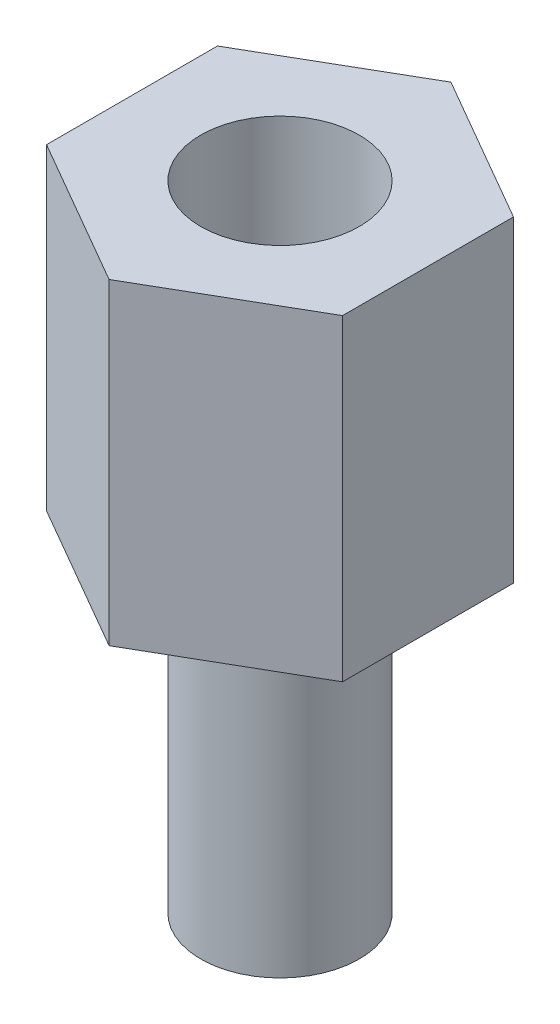
ISO-10303-21;
HEADER;
FILE_DESCRIPTION(('STEP AP214'),'2;1');
FILE_NAME('part.step','',(''),(''),'','','');
FILE_SCHEMA(('AUTOMOTIVE_DESIGN { 1 0 10303 214 1 1 1 1 }'));
ENDSEC;
DATA;
#1=APPLICATION_CONTEXT('core data for automotive mechanical design processes');
#2=APPLICATION_PROTOCOL_DEFINITION('international standard','automotive_design',2000,#1);
#3=PRODUCT_CONTEXT('',#1,'mechanical');
#4=PRODUCT('Part','Part','',(#3));
#5=PRODUCT_RELATED_PRODUCT_CATEGORY('part','',(#4));
#6=PRODUCT_DEFINITION_FORMATION('','',#4);
#7=PRODUCT_DEFINITION_CONTEXT('part definition',#1,'design');
#8=PRODUCT_DEFINITION('design','',#6,#7);
#9=PRODUCT_DEFINITION_SHAPE('','',#8);
#10=(LENGTH_UNIT() NAMED_UNIT(*) SI_UNIT(.MILLI.,.METRE.));
#11=(NAMED_UNIT(*) PLANE_ANGLE_UNIT() SI_UNIT($,.RADIAN.));
#12=(NAMED_UNIT(*) SI_UNIT($,.STERADIAN.) SOLID_ANGLE_UNIT());
#13=UNCERTAINTY_MEASURE_WITH_UNIT(LENGTH_MEASURE(1.E-05),#10,'distance_accuracy_value','');
#14=(GEOMETRIC_REPRESENTATION_CONTEXT(3) GLOBAL_UNCERTAINTY_ASSIGNED_CONTEXT((#13)) GLOBAL_UNIT_ASSIGNED_CONTEXT((#10,
#11,#12)) REPRESENTATION_CONTEXT('',''));
#15=CARTESIAN_POINT('',(0.,0.,0.));
#16=DIRECTION('',(0.,0.,1.));
#17=DIRECTION('',(1.,0.,0.));
#18=AXIS2_PLACEMENT_3D('',#15,#16,#17);
#19=CARTESIAN_POINT('',(-2.79999999999998,6.,1.61658075373099));
#20=DIRECTION('',(0.499999999999995,0.,-0.866025403784441));
#21=DIRECTION('',(-0.866025403784441,0.,-0.499999999999995));
#22=AXIS2_PLACEMENT_3D('',#19,#20,#21);
#23=PLANE('',#22);
#24=DIRECTION('',(0.866025403784442,0.,0.499999999999995));
#25=VECTOR('',#24,1.);
#26=CARTESIAN_POINT('',(-2.79999999999998,0.,1.61658075373099));
#27=LINE('',#26,#25);
#28=CARTESIAN_POINT('',(-2.79999999999998,0.,1.61658075373099));
#29=VERTEX_POINT('',#28);
#30=CARTESIAN_POINT('',(0.,0.,3.23316150746191));
#31=VERTEX_POINT('',#30);
#32=EDGE_CURVE('E119',#29,#31,#27,.T.);
#33=ORIENTED_EDGE('',*,*,#32,.T.);
#34=DIRECTION('',(0.,-1.,0.));
#35=VECTOR('',#34,1.);
#36=CARTESIAN_POINT('',(0.,6.,3.23316150746191));
#37=LINE('',#36,#35);
#38=CARTESIAN_POINT('',(0.,6.,3.23316150746191));
#39=VERTEX_POINT('',#38);
#40=EDGE_CURVE('E36',#39,#31,#37,.T.);
#41=ORIENTED_EDGE('',*,*,#40,.F.);
#42=DIRECTION('',(0.866025403784442,0.,0.499999999999995));
#43=VECTOR('',#42,1.);
#44=CARTESIAN_POINT('',(-2.79999999999998,6.,1.61658075373099));
#45=LINE('',#44,#43);
#46=CARTESIAN_POINT('',(-2.79999999999998,6.,1.61658075373099));
#47=VERTEX_POINT('',#46);
#48=EDGE_CURVE('E130',#47,#39,#45,.T.);
#49=ORIENTED_EDGE('',*,*,#48,.F.);
#50=DIRECTION('',(0.,-1.,0.));
#51=VECTOR('',#50,1.);
#52=CARTESIAN_POINT('',(-2.79999999999998,6.,1.61658075373099));
#53=LINE('',#52,#51);
#54=EDGE_CURVE('E115',#47,#29,#53,.T.);
#55=ORIENTED_EDGE('',*,*,#54,.T.);
#56=EDGE_LOOP('',(#33,#41,#49,#55));
#57=FACE_BOUND('',#56,.T.);
#58=ADVANCED_FACE('F33',(#57),#23,.F.);
#59=CARTESIAN_POINT('',(0.,6.,3.23316150746191));
#60=DIRECTION('',(-0.500000000000001,0.,-0.866025403784438));
#61=DIRECTION('',(-0.866025403784438,0.,0.500000000000001));
#62=AXIS2_PLACEMENT_3D('',#59,#60,#61);
#63=PLANE('',#62);
#64=DIRECTION('',(0.866025403784438,0.,-0.500000000000001));
#65=VECTOR('',#64,1.);
#66=CARTESIAN_POINT('',(0.,0.,3.23316150746191));
#67=LINE('',#66,#65);
#68=CARTESIAN_POINT('',(2.80000000000001,0.,1.61658075373095));
#69=VERTEX_POINT('',#68);
#70=EDGE_CURVE('E122',#31,#69,#67,.T.);
#71=ORIENTED_EDGE('',*,*,#70,.T.);
#72=DIRECTION('',(0.,-1.,0.));
#73=VECTOR('',#72,1.);
#74=CARTESIAN_POINT('',(2.80000000000001,6.,1.61658075373095));
#75=LINE('',#74,#73);
#76=CARTESIAN_POINT('',(2.80000000000001,6.,1.61658075373095));
#77=VERTEX_POINT('',#76);
#78=EDGE_CURVE('E133',#77,#69,#75,.T.);
#79=ORIENTED_EDGE('',*,*,#78,.F.);
#80=DIRECTION('',(0.866025403784438,0.,-0.500000000000001));
#81=VECTOR('',#80,1.);
#82=CARTESIAN_POINT('',(0.,6.,3.23316150746191));
#83=LINE('',#82,#81);
#84=EDGE_CURVE('E88',#39,#77,#83,.T.);
#85=ORIENTED_EDGE('',*,*,#84,.F.);
#86=ORIENTED_EDGE('',*,*,#40,.T.);
#87=EDGE_LOOP('',(#71,#79,#85,#86));
#88=FACE_BOUND('',#87,.T.);
#89=ADVANCED_FACE('F138',(#88),#63,.F.);
#90=CARTESIAN_POINT('',(2.80000000000001,6.,1.61658075373095));
#91=DIRECTION('',(-1.,0.,0.));
#92=DIRECTION('',(0.,0.,1.));
#93=AXIS2_PLACEMENT_3D('',#90,#91,#92);
#94=PLANE('',#93);
#95=DIRECTION('',(0.,0.,-1.));
#96=VECTOR('',#95,1.);
#97=CARTESIAN_POINT('',(2.80000000000001,0.,1.61658075373095));
#98=LINE('',#97,#96);
#99=CARTESIAN_POINT('',(2.8,0.,-1.61658075373097));
#100=VERTEX_POINT('',#99);
#101=EDGE_CURVE('E125',#69,#100,#98,.T.);
#102=ORIENTED_EDGE('',*,*,#101,.T.);
#103=DIRECTION('',(0.,-1.,0.));
#104=VECTOR('',#103,1.);
#105=CARTESIAN_POINT('',(2.8,6.,-1.61658075373097));
#106=LINE('',#105,#104);
#107=CARTESIAN_POINT('',(2.8,6.,-1.61658075373097));
#108=VERTEX_POINT('',#107);
#109=EDGE_CURVE('E110',#108,#100,#106,.T.);
#110=ORIENTED_EDGE('',*,*,#109,.F.);
#111=DIRECTION('',(0.,0.,-1.));
#112=VECTOR('',#111,1.);
#113=CARTESIAN_POINT('',(2.80000000000001,6.,1.61658075373095));
#114=LINE('',#113,#112);
#115=EDGE_CURVE('E101',#77,#108,#114,.T.);
#116=ORIENTED_EDGE('',*,*,#115,.F.);
#117=ORIENTED_EDGE('',*,*,#78,.T.);
#118=EDGE_LOOP('',(#102,#110,#116,#117));
#119=FACE_BOUND('',#118,.T.);
#120=ADVANCED_FACE('F144',(#119),#94,.F.);
#121=CARTESIAN_POINT('',(2.8,6.,-1.61658075373097));
#122=DIRECTION('',(-0.499999999999995,0.,0.866025403784441));
#123=DIRECTION('',(0.866025403784442,0.,0.499999999999995));
#124=AXIS2_PLACEMENT_3D('',#121,#122,#123);
#125=PLANE('',#124);
#126=DIRECTION('',(-0.866025403784442,0.,-0.499999999999995));
#127=VECTOR('',#126,1.);
#128=CARTESIAN_POINT('',(2.8,0.,-1.61658075373097));
#129=LINE('',#128,#127);
#130=CARTESIAN_POINT('',(0.,0.,-3.23316150746191));
#131=VERTEX_POINT('',#130);
#132=EDGE_CURVE('E109',#100,#131,#129,.T.);
#133=ORIENTED_EDGE('',*,*,#132,.T.);
#134=DIRECTION('',(0.,-1.,0.));
#135=VECTOR('',#134,1.);
#136=CARTESIAN_POINT('',(0.,6.,-3.23316150746191));
#137=LINE('',#136,#135);
#138=CARTESIAN_POINT('',(0.,6.,-3.23316150746191));
#139=VERTEX_POINT('',#138);
#140=EDGE_CURVE('E106',#139,#131,#137,.T.);
#141=ORIENTED_EDGE('',*,*,#140,.F.);
#142=DIRECTION('',(-0.866025403784442,0.,-0.499999999999995));
#143=VECTOR('',#142,1.);
#144=CARTESIAN_POINT('',(2.8,6.,-1.61658075373097));
#145=LINE('',#144,#143);
#146=EDGE_CURVE('E95',#108,#139,#145,.T.);
#147=ORIENTED_EDGE('',*,*,#146,.F.);
#148=ORIENTED_EDGE('',*,*,#109,.T.);
#149=EDGE_LOOP('',(#133,#141,#147,#148));
#150=FACE_BOUND('',#149,.T.);
#151=ADVANCED_FACE('F107',(#150),#125,.F.);
#152=CARTESIAN_POINT('',(0.,6.,-3.23316150746191));
#153=DIRECTION('',(0.500000000000007,0.,0.866025403784435));
#154=DIRECTION('',(0.866025403784434,0.,-0.500000000000007));
#155=AXIS2_PLACEMENT_3D('',#152,#153,#154);
#156=PLANE('',#155);
#157=DIRECTION('',(-0.866025403784435,0.,0.500000000000007));
#158=VECTOR('',#157,1.);
#159=CARTESIAN_POINT('',(0.,0.,-3.23316150746191));
#160=LINE('',#159,#158);
#161=CARTESIAN_POINT('',(-2.80000000000002,0.,-1.61658075373093));
#162=VERTEX_POINT('',#161);
#163=EDGE_CURVE('E73',#131,#162,#160,.T.);
#164=ORIENTED_EDGE('',*,*,#163,.T.);
#165=DIRECTION('',(0.,-1.,0.));
#166=VECTOR('',#165,1.);
#167=CARTESIAN_POINT('',(-2.80000000000002,6.,-1.61658075373093));
#168=LINE('',#167,#166);
#169=CARTESIAN_POINT('',(-2.80000000000002,6.,-1.61658075373093));
#170=VERTEX_POINT('',#169);
#171=EDGE_CURVE('E111',#170,#162,#168,.T.);
#172=ORIENTED_EDGE('',*,*,#171,.F.);
#173=DIRECTION('',(-0.866025403784435,0.,0.500000000000007));
#174=VECTOR('',#173,1.);
#175=CARTESIAN_POINT('',(0.,6.,-3.23316150746191));
#176=LINE('',#175,#174);
#177=EDGE_CURVE('E99',#139,#170,#176,.T.);
#178=ORIENTED_EDGE('',*,*,#177,.F.);
#179=ORIENTED_EDGE('',*,*,#140,.T.);
#180=EDGE_LOOP('',(#164,#172,#178,#179));
#181=FACE_BOUND('',#180,.T.);
#182=ADVANCED_FACE('F113',(#181),#156,.F.);
#183=CARTESIAN_POINT('',(-2.80000000000002,6.,-1.61658075373093));
#184=DIRECTION('',(1.,0.,0.));
#185=DIRECTION('',(0.,0.,-1.));
#186=AXIS2_PLACEMENT_3D('',#183,#184,#185);
#187=PLANE('',#186);
#188=DIRECTION('',(0.,0.,1.));
#189=VECTOR('',#188,1.);
#190=CARTESIAN_POINT('',(-2.80000000000002,0.,-1.61658075373093));
#191=LINE('',#190,#189);
#192=EDGE_CURVE('E79',#162,#29,#191,.T.);
#193=ORIENTED_EDGE('',*,*,#192,.T.);
#194=ORIENTED_EDGE('',*,*,#54,.F.);
#195=DIRECTION('',(0.,0.,1.));
#196=VECTOR('',#195,1.);
#197=CARTESIAN_POINT('',(-2.80000000000002,6.,-1.61658075373093));
#198=LINE('',#197,#196);
#199=EDGE_CURVE('E50',#170,#47,#198,.T.);
#200=ORIENTED_EDGE('',*,*,#199,.F.);
#201=ORIENTED_EDGE('',*,*,#171,.T.);
#202=EDGE_LOOP('',(#193,#194,#200,#201));
#203=FACE_BOUND('',#202,.T.);
#204=ADVANCED_FACE('F167',(#203),#187,.F.);
#205=CARTESIAN_POINT('',(0.,6.,0.));
#206=DIRECTION('',(0.,1.,0.));
#207=DIRECTION('',(0.,0.,1.));
#208=AXIS2_PLACEMENT_3D('',#205,#206,#207);
#209=PLANE('',#208);
#210=CARTESIAN_POINT('',(0.,6.,0.));
#211=DIRECTION('',(0.,1.,0.));
#212=DIRECTION('',(0.,0.,1.));
#213=AXIS2_PLACEMENT_3D('',#210,#211,#212);
#214=CIRCLE('',#213,1.5);
#215=CARTESIAN_POINT('',(0.,6.,1.5));
#216=VERTEX_POINT('',#215);
#217=EDGE_CURVE('E151',#216,#216,#214,.T.);
#218=ORIENTED_EDGE('',*,*,#217,.F.);
#219=EDGE_LOOP('',(#218));
#220=FACE_BOUND('',#219,.T.);
#221=ORIENTED_EDGE('',*,*,#48,.T.);
#222=ORIENTED_EDGE('',*,*,#84,.T.);
#223=ORIENTED_EDGE('',*,*,#115,.T.);
#224=ORIENTED_EDGE('',*,*,#146,.T.);
#225=ORIENTED_EDGE('',*,*,#177,.T.);
#226=ORIENTED_EDGE('',*,*,#199,.T.);
#227=EDGE_LOOP('',(#221,#222,#223,#224,#225,#226));
#228=FACE_BOUND('',#227,.T.);
#229=ADVANCED_FACE('F97',(#220,#228),#209,.T.);
#230=CARTESIAN_POINT('',(0.,0.,0.));
#231=DIRECTION('',(0.,1.,0.));
#232=DIRECTION('',(0.,0.,1.));
#233=AXIS2_PLACEMENT_3D('',#230,#231,#232);
#234=PLANE('',#233);
#235=CARTESIAN_POINT('',(0.,0.,0.));
#236=DIRECTION('',(0.,-1.,0.));
#237=DIRECTION('',(0.,0.,-1.));
#238=AXIS2_PLACEMENT_3D('',#235,#236,#237);
#239=CIRCLE('',#238,1.5);
#240=CARTESIAN_POINT('',(0.,0.,-1.5));
#241=VERTEX_POINT('',#240);
#242=EDGE_CURVE('E11',#241,#241,#239,.T.);
#243=ORIENTED_EDGE('',*,*,#242,.F.);
#244=EDGE_LOOP('',(#243));
#245=FACE_BOUND('',#244,.T.);
#246=ORIENTED_EDGE('',*,*,#32,.F.);
#247=ORIENTED_EDGE('',*,*,#192,.F.);
#248=ORIENTED_EDGE('',*,*,#163,.F.);
#249=ORIENTED_EDGE('',*,*,#132,.F.);
#250=ORIENTED_EDGE('',*,*,#101,.F.);
#251=ORIENTED_EDGE('',*,*,#70,.F.);
#252=EDGE_LOOP('',(#246,#247,#248,#249,#250,#251));
#253=FACE_BOUND('',#252,.T.);
#254=ADVANCED_FACE('F143',(#245,#253),#234,.F.);
#255=CARTESIAN_POINT('',(0.,-6.,0.));
#256=DIRECTION('',(0.,1.,0.));
#257=DIRECTION('',(0.,0.,1.));
#258=AXIS2_PLACEMENT_3D('',#255,#256,#257);
#259=CYLINDRICAL_SURFACE('',#258,1.5);
#260=CARTESIAN_POINT('',(0.,-6.,0.));
#261=DIRECTION('',(0.,-1.,0.));
#262=DIRECTION('',(0.,0.,-1.));
#263=AXIS2_PLACEMENT_3D('',#260,#261,#262);
#264=CIRCLE('',#263,1.5);
#265=CARTESIAN_POINT('',(0.,-6.,-1.5));
#266=VERTEX_POINT('',#265);
#267=EDGE_CURVE('E123',#266,#266,#264,.T.);
#268=ORIENTED_EDGE('',*,*,#267,.F.);
#269=EDGE_LOOP('',(#268));
#270=FACE_BOUND('',#269,.T.);
#271=ORIENTED_EDGE('',*,*,#242,.T.);
#272=EDGE_LOOP('',(#271));
#273=FACE_BOUND('',#272,.T.);
#274=ADVANCED_FACE('F173',(#270,#273),#259,.T.);
#275=CARTESIAN_POINT('',(0.,-6.,0.));
#276=DIRECTION('',(0.,-1.,0.));
#277=DIRECTION('',(0.,0.,-1.));
#278=AXIS2_PLACEMENT_3D('',#275,#276,#277);
#279=PLANE('',#278);
#280=ORIENTED_EDGE('',*,*,#267,.T.);
#281=EDGE_LOOP('',(#280));
#282=FACE_BOUND('',#281,.T.);
#283=ADVANCED_FACE('F162',(#282),#279,.T.);
#284=CARTESIAN_POINT('',(0.,2.,0.));
#285=DIRECTION('',(0.,1.,0.));
#286=DIRECTION('',(0.,0.,1.));
#287=AXIS2_PLACEMENT_3D('',#284,#285,#286);
#288=CYLINDRICAL_SURFACE('',#287,1.5);
#289=CARTESIAN_POINT('',(0.,2.,0.));
#290=DIRECTION('',(0.,1.,0.));
#291=DIRECTION('',(0.,0.,1.));
#292=AXIS2_PLACEMENT_3D('',#289,#290,#291);
#293=CIRCLE('',#292,1.5);
#294=CARTESIAN_POINT('',(0.,2.,1.5));
#295=VERTEX_POINT('',#294);
#296=EDGE_CURVE('E150',#295,#295,#293,.T.);
#297=ORIENTED_EDGE('',*,*,#296,.F.);
#298=EDGE_LOOP('',(#297));
#299=FACE_BOUND('',#298,.T.);
#300=ORIENTED_EDGE('',*,*,#217,.T.);
#301=EDGE_LOOP('',(#300));
#302=FACE_BOUND('',#301,.T.);
#303=ADVANCED_FACE('F159',(#299,#302),#288,.F.);
#304=CARTESIAN_POINT('',(0.,2.,0.));
#305=DIRECTION('',(0.,1.,0.));
#306=DIRECTION('',(0.,0.,1.));
#307=AXIS2_PLACEMENT_3D('',#304,#305,#306);
#308=PLANE('',#307);
#309=ORIENTED_EDGE('',*,*,#296,.T.);
#310=EDGE_LOOP('',(#309));
#311=FACE_BOUND('',#310,.T.);
#312=ADVANCED_FACE('F157',(#311),#308,.T.);
#313=CLOSED_SHELL('',(#58,#89,#120,#151,#182,#204,#229,#254,#274,#283,#303,#312));
#314=MANIFOLD_SOLID_BREP('B2',#313);
#315=ADVANCED_BREP_SHAPE_REPRESENTATION('',(#18,#314),#14);
#316=SHAPE_DEFINITION_REPRESENTATION(#9,#315);
ENDSEC;
END-ISO-10303-21;
